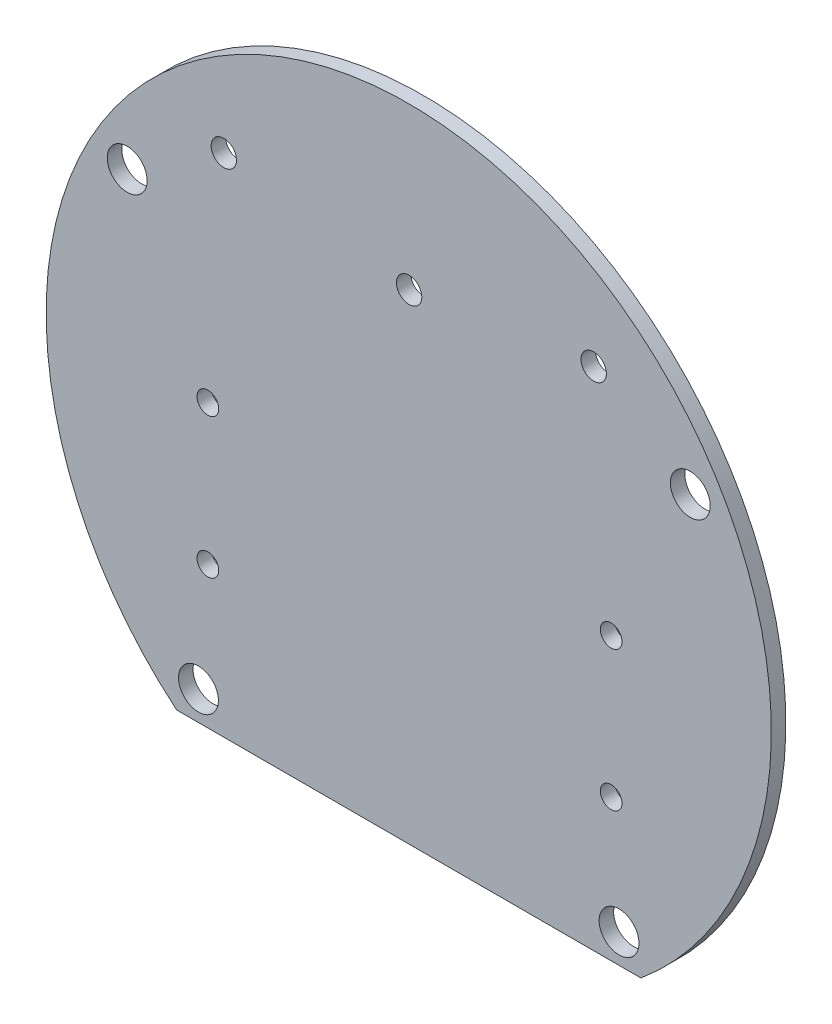
ISO-10303-21;
HEADER;
FILE_DESCRIPTION(('STEP AP214'),'2;1');
FILE_NAME('part.step','',(''),(''),'','','');
FILE_SCHEMA(('AUTOMOTIVE_DESIGN { 1 0 10303 214 1 1 1 1 }'));
ENDSEC;
DATA;
#1=APPLICATION_CONTEXT('core data for automotive mechanical design processes');
#2=APPLICATION_PROTOCOL_DEFINITION('international standard','automotive_design',2000,#1);
#3=PRODUCT_CONTEXT('',#1,'mechanical');
#4=PRODUCT('Part','Part','',(#3));
#5=PRODUCT_RELATED_PRODUCT_CATEGORY('part','',(#4));
#6=PRODUCT_DEFINITION_FORMATION('','',#4);
#7=PRODUCT_DEFINITION_CONTEXT('part definition',#1,'design');
#8=PRODUCT_DEFINITION('design','',#6,#7);
#9=PRODUCT_DEFINITION_SHAPE('','',#8);
#10=(LENGTH_UNIT() NAMED_UNIT(*) SI_UNIT(.MILLI.,.METRE.));
#11=(NAMED_UNIT(*) PLANE_ANGLE_UNIT() SI_UNIT($,.RADIAN.));
#12=(NAMED_UNIT(*) SI_UNIT($,.STERADIAN.) SOLID_ANGLE_UNIT());
#13=UNCERTAINTY_MEASURE_WITH_UNIT(LENGTH_MEASURE(1.E-05),#10,'distance_accuracy_value','');
#14=(GEOMETRIC_REPRESENTATION_CONTEXT(3) GLOBAL_UNCERTAINTY_ASSIGNED_CONTEXT((#13)) GLOBAL_UNIT_ASSIGNED_CONTEXT((#10,
#11,#12)) REPRESENTATION_CONTEXT('',''));
#15=CARTESIAN_POINT('',(0.,0.,0.));
#16=DIRECTION('',(0.,0.,1.));
#17=DIRECTION('',(1.,0.,0.));
#18=AXIS2_PLACEMENT_3D('',#15,#16,#17);
#19=CARTESIAN_POINT('',(0.,0.,2.));
#20=DIRECTION('',(0.,0.,-1.));
#21=DIRECTION('',(-1.,0.,0.));
#22=AXIS2_PLACEMENT_3D('',#19,#20,#21);
#23=CYLINDRICAL_SURFACE('',#22,50.);
#24=DIRECTION('',(0.,0.,-1.));
#25=VECTOR('',#24,1.);
#26=CARTESIAN_POINT('',(-32.0113353588168,-38.4093010681705,2.));
#27=LINE('',#26,#25);
#28=CARTESIAN_POINT('',(-32.0113353588168,-38.4093010681705,2.));
#29=VERTEX_POINT('',#28);
#30=CARTESIAN_POINT('',(-32.0113353588168,-38.4093010681705,0.));
#31=VERTEX_POINT('',#30);
#32=EDGE_CURVE('E49',#29,#31,#27,.T.);
#33=ORIENTED_EDGE('',*,*,#32,.F.);
#34=CARTESIAN_POINT('',(0.,0.,2.));
#35=DIRECTION('',(0.,0.,1.));
#36=DIRECTION('',(1.,0.,0.));
#37=AXIS2_PLACEMENT_3D('',#34,#35,#36);
#38=CIRCLE('',#37,50.);
#39=CARTESIAN_POINT('',(32.0113353588168,-38.4093010681705,2.));
#40=VERTEX_POINT('',#39);
#41=EDGE_CURVE('E43',#40,#29,#38,.T.);
#42=ORIENTED_EDGE('',*,*,#41,.F.);
#43=DIRECTION('',(0.,0.,-1.));
#44=VECTOR('',#43,1.);
#45=CARTESIAN_POINT('',(32.0113353588168,-38.4093010681705,2.));
#46=LINE('',#45,#44);
#47=CARTESIAN_POINT('',(32.0113353588168,-38.4093010681705,0.));
#48=VERTEX_POINT('',#47);
#49=EDGE_CURVE('E60',#48,#40,#46,.F.);
#50=ORIENTED_EDGE('',*,*,#49,.F.);
#51=CARTESIAN_POINT('',(0.,0.,0.));
#52=DIRECTION('',(0.,0.,1.));
#53=DIRECTION('',(1.,0.,0.));
#54=AXIS2_PLACEMENT_3D('',#51,#52,#53);
#55=CIRCLE('',#54,50.);
#56=EDGE_CURVE('E66',#48,#31,#55,.T.);
#57=ORIENTED_EDGE('',*,*,#56,.T.);
#58=EDGE_LOOP('',(#33,#42,#50,#57));
#59=FACE_BOUND('',#58,.T.);
#60=ADVANCED_FACE('F36',(#59),#23,.T.);
#61=CARTESIAN_POINT('',(0.,0.,2.));
#62=DIRECTION('',(0.,0.,1.));
#63=DIRECTION('',(1.,0.,0.));
#64=AXIS2_PLACEMENT_3D('',#61,#62,#63);
#65=PLANE('',#64);
#66=CARTESIAN_POINT('',(25.5,31.36,2.));
#67=DIRECTION('',(0.,0.,1.));
#68=DIRECTION('',(1.,0.,0.));
#69=AXIS2_PLACEMENT_3D('',#66,#67,#68);
#70=CIRCLE('',#69,1.75);
#71=CARTESIAN_POINT('',(27.25,31.36,2.));
#72=VERTEX_POINT('',#71);
#73=EDGE_CURVE('E68',#72,#72,#70,.T.);
#74=ORIENTED_EDGE('',*,*,#73,.F.);
#75=EDGE_LOOP('',(#74));
#76=FACE_BOUND('',#75,.T.);
#77=CARTESIAN_POINT('',(-25.5,31.36,2.));
#78=DIRECTION('',(0.,0.,1.));
#79=DIRECTION('',(1.,0.,0.));
#80=AXIS2_PLACEMENT_3D('',#77,#78,#79);
#81=CIRCLE('',#80,1.75);
#82=CARTESIAN_POINT('',(-23.75,31.36,2.));
#83=VERTEX_POINT('',#82);
#84=EDGE_CURVE('E101',#83,#83,#81,.T.);
#85=ORIENTED_EDGE('',*,*,#84,.F.);
#86=EDGE_LOOP('',(#85));
#87=FACE_BOUND('',#86,.T.);
#88=CARTESIAN_POINT('',(27.91,0.439999999999989,2.));
#89=DIRECTION('',(0.,0.,1.));
#90=DIRECTION('',(1.,0.,0.));
#91=AXIS2_PLACEMENT_3D('',#88,#89,#90);
#92=CIRCLE('',#91,1.5);
#93=CARTESIAN_POINT('',(29.41,0.439999999999989,2.));
#94=VERTEX_POINT('',#93);
#95=EDGE_CURVE('E104',#94,#94,#92,.T.);
#96=ORIENTED_EDGE('',*,*,#95,.F.);
#97=EDGE_LOOP('',(#96));
#98=FACE_BOUND('',#97,.T.);
#99=CARTESIAN_POINT('',(-27.7,0.439999999999996,2.));
#100=DIRECTION('',(0.,0.,1.));
#101=DIRECTION('',(1.,0.,0.));
#102=AXIS2_PLACEMENT_3D('',#99,#100,#101);
#103=CIRCLE('',#102,1.5);
#104=CARTESIAN_POINT('',(-26.2,0.439999999999996,2.));
#105=VERTEX_POINT('',#104);
#106=EDGE_CURVE('E107',#105,#105,#103,.T.);
#107=ORIENTED_EDGE('',*,*,#106,.F.);
#108=EDGE_LOOP('',(#107));
#109=FACE_BOUND('',#108,.T.);
#110=CARTESIAN_POINT('',(-27.7,-18.86,2.));
#111=DIRECTION('',(0.,0.,1.));
#112=DIRECTION('',(1.,0.,0.));
#113=AXIS2_PLACEMENT_3D('',#110,#111,#112);
#114=CIRCLE('',#113,1.5);
#115=CARTESIAN_POINT('',(-26.2,-18.86,2.));
#116=VERTEX_POINT('',#115);
#117=EDGE_CURVE('E110',#116,#116,#114,.T.);
#118=ORIENTED_EDGE('',*,*,#117,.F.);
#119=EDGE_LOOP('',(#118));
#120=FACE_BOUND('',#119,.T.);
#121=CARTESIAN_POINT('',(27.91,-18.86,2.));
#122=DIRECTION('',(0.,0.,1.));
#123=DIRECTION('',(1.,0.,0.));
#124=AXIS2_PLACEMENT_3D('',#121,#122,#123);
#125=CIRCLE('',#124,1.5);
#126=CARTESIAN_POINT('',(29.41,-18.86,2.));
#127=VERTEX_POINT('',#126);
#128=EDGE_CURVE('E113',#127,#127,#125,.T.);
#129=ORIENTED_EDGE('',*,*,#128,.F.);
#130=EDGE_LOOP('',(#129));
#131=FACE_BOUND('',#130,.T.);
#132=CARTESIAN_POINT('',(0.0499999999999968,27.79,2.));
#133=DIRECTION('',(0.,0.,1.));
#134=DIRECTION('',(1.,0.,0.));
#135=AXIS2_PLACEMENT_3D('',#132,#133,#134);
#136=CIRCLE('',#135,1.75);
#137=CARTESIAN_POINT('',(1.8,27.79,2.));
#138=VERTEX_POINT('',#137);
#139=EDGE_CURVE('E116',#138,#138,#136,.T.);
#140=ORIENTED_EDGE('',*,*,#139,.F.);
#141=EDGE_LOOP('',(#140));
#142=FACE_BOUND('',#141,.T.);
#143=CARTESIAN_POINT('',(38.8241975308642,22.7526193235952,2.));
#144=DIRECTION('',(0.,0.,1.));
#145=DIRECTION('',(1.,0.,0.));
#146=AXIS2_PLACEMENT_3D('',#143,#144,#145);
#147=CIRCLE('',#146,2.75);
#148=CARTESIAN_POINT('',(41.5741975308642,22.7526193235952,2.));
#149=VERTEX_POINT('',#148);
#150=EDGE_CURVE('E80',#149,#149,#147,.T.);
#151=ORIENTED_EDGE('',*,*,#150,.F.);
#152=EDGE_LOOP('',(#151));
#153=FACE_BOUND('',#152,.T.);
#154=CARTESIAN_POINT('',(-38.8241975308642,22.7526193235952,2.));
#155=DIRECTION('',(0.,0.,1.));
#156=DIRECTION('',(1.,0.,0.));
#157=AXIS2_PLACEMENT_3D('',#154,#155,#156);
#158=CIRCLE('',#157,2.75);
#159=CARTESIAN_POINT('',(-36.0741975308642,22.7526193235952,2.));
#160=VERTEX_POINT('',#159);
#161=EDGE_CURVE('E86',#160,#160,#158,.T.);
#162=ORIENTED_EDGE('',*,*,#161,.F.);
#163=EDGE_LOOP('',(#162));
#164=FACE_BOUND('',#163,.T.);
#165=CARTESIAN_POINT('',(29.,-34.4093010681705,2.));
#166=DIRECTION('',(0.,0.,1.));
#167=DIRECTION('',(1.,0.,0.));
#168=AXIS2_PLACEMENT_3D('',#165,#166,#167);
#169=CIRCLE('',#168,2.75);
#170=CARTESIAN_POINT('',(31.75,-34.4093010681705,2.));
#171=VERTEX_POINT('',#170);
#172=EDGE_CURVE('E92',#171,#171,#169,.T.);
#173=ORIENTED_EDGE('',*,*,#172,.F.);
#174=EDGE_LOOP('',(#173));
#175=FACE_BOUND('',#174,.T.);
#176=CARTESIAN_POINT('',(-29.,-34.4093010681705,2.));
#177=DIRECTION('',(0.,0.,1.));
#178=DIRECTION('',(1.,0.,0.));
#179=AXIS2_PLACEMENT_3D('',#176,#177,#178);
#180=CIRCLE('',#179,2.75);
#181=CARTESIAN_POINT('',(-26.25,-34.4093010681705,2.));
#182=VERTEX_POINT('',#181);
#183=EDGE_CURVE('E74',#182,#182,#180,.T.);
#184=ORIENTED_EDGE('',*,*,#183,.F.);
#185=EDGE_LOOP('',(#184));
#186=FACE_BOUND('',#185,.T.);
#187=ORIENTED_EDGE('',*,*,#41,.T.);
#188=DIRECTION('',(1.,0.,0.));
#189=VECTOR('',#188,1.);
#190=CARTESIAN_POINT('',(0.,-38.4093010681705,2.));
#191=LINE('',#190,#189);
#192=EDGE_CURVE('E54',#29,#40,#191,.T.);
#193=ORIENTED_EDGE('',*,*,#192,.T.);
#194=EDGE_LOOP('',(#187,#193));
#195=FACE_BOUND('',#194,.T.);
#196=ADVANCED_FACE('F146',(#76,#87,#98,#109,#120,#131,#142,#153,#164,#175,#186,#195),#65,.T.);
#197=CARTESIAN_POINT('',(0.,0.,0.));
#198=DIRECTION('',(0.,0.,1.));
#199=DIRECTION('',(1.,0.,0.));
#200=AXIS2_PLACEMENT_3D('',#197,#198,#199);
#201=PLANE('',#200);
#202=CARTESIAN_POINT('',(25.5,31.36,0.));
#203=DIRECTION('',(0.,0.,-1.));
#204=DIRECTION('',(-1.,0.,0.));
#205=AXIS2_PLACEMENT_3D('',#202,#203,#204);
#206=CIRCLE('',#205,1.75);
#207=CARTESIAN_POINT('',(23.75,31.36,0.));
#208=VERTEX_POINT('',#207);
#209=EDGE_CURVE('E123',#208,#208,#206,.T.);
#210=ORIENTED_EDGE('',*,*,#209,.F.);
#211=EDGE_LOOP('',(#210));
#212=FACE_BOUND('',#211,.T.);
#213=CARTESIAN_POINT('',(-25.5,31.36,0.));
#214=DIRECTION('',(0.,0.,-1.));
#215=DIRECTION('',(-1.,0.,0.));
#216=AXIS2_PLACEMENT_3D('',#213,#214,#215);
#217=CIRCLE('',#216,1.75);
#218=CARTESIAN_POINT('',(-27.25,31.36,0.));
#219=VERTEX_POINT('',#218);
#220=EDGE_CURVE('E126',#219,#219,#217,.T.);
#221=ORIENTED_EDGE('',*,*,#220,.F.);
#222=EDGE_LOOP('',(#221));
#223=FACE_BOUND('',#222,.T.);
#224=CARTESIAN_POINT('',(27.91,0.439999999999989,0.));
#225=DIRECTION('',(0.,0.,-1.));
#226=DIRECTION('',(-1.,0.,0.));
#227=AXIS2_PLACEMENT_3D('',#224,#225,#226);
#228=CIRCLE('',#227,1.5);
#229=CARTESIAN_POINT('',(26.41,0.439999999999989,0.));
#230=VERTEX_POINT('',#229);
#231=EDGE_CURVE('E129',#230,#230,#228,.T.);
#232=ORIENTED_EDGE('',*,*,#231,.F.);
#233=EDGE_LOOP('',(#232));
#234=FACE_BOUND('',#233,.T.);
#235=CARTESIAN_POINT('',(-27.7,0.439999999999996,0.));
#236=DIRECTION('',(0.,0.,-1.));
#237=DIRECTION('',(-1.,0.,0.));
#238=AXIS2_PLACEMENT_3D('',#235,#236,#237);
#239=CIRCLE('',#238,1.5);
#240=CARTESIAN_POINT('',(-29.2,0.439999999999996,0.));
#241=VERTEX_POINT('',#240);
#242=EDGE_CURVE('E132',#241,#241,#239,.T.);
#243=ORIENTED_EDGE('',*,*,#242,.F.);
#244=EDGE_LOOP('',(#243));
#245=FACE_BOUND('',#244,.T.);
#246=CARTESIAN_POINT('',(-27.7,-18.86,0.));
#247=DIRECTION('',(0.,0.,-1.));
#248=DIRECTION('',(-1.,0.,0.));
#249=AXIS2_PLACEMENT_3D('',#246,#247,#248);
#250=CIRCLE('',#249,1.5);
#251=CARTESIAN_POINT('',(-29.2,-18.86,0.));
#252=VERTEX_POINT('',#251);
#253=EDGE_CURVE('E135',#252,#252,#250,.T.);
#254=ORIENTED_EDGE('',*,*,#253,.F.);
#255=EDGE_LOOP('',(#254));
#256=FACE_BOUND('',#255,.T.);
#257=CARTESIAN_POINT('',(27.91,-18.86,0.));
#258=DIRECTION('',(0.,0.,-1.));
#259=DIRECTION('',(-1.,0.,0.));
#260=AXIS2_PLACEMENT_3D('',#257,#258,#259);
#261=CIRCLE('',#260,1.5);
#262=CARTESIAN_POINT('',(26.41,-18.86,0.));
#263=VERTEX_POINT('',#262);
#264=EDGE_CURVE('E122',#263,#263,#261,.T.);
#265=ORIENTED_EDGE('',*,*,#264,.F.);
#266=EDGE_LOOP('',(#265));
#267=FACE_BOUND('',#266,.T.);
#268=CARTESIAN_POINT('',(0.0499999999999968,27.79,0.));
#269=DIRECTION('',(0.,0.,-1.));
#270=DIRECTION('',(-1.,0.,0.));
#271=AXIS2_PLACEMENT_3D('',#268,#269,#270);
#272=CIRCLE('',#271,1.75);
#273=CARTESIAN_POINT('',(-1.7,27.79,0.));
#274=VERTEX_POINT('',#273);
#275=EDGE_CURVE('E119',#274,#274,#272,.T.);
#276=ORIENTED_EDGE('',*,*,#275,.F.);
#277=EDGE_LOOP('',(#276));
#278=FACE_BOUND('',#277,.T.);
#279=CARTESIAN_POINT('',(-29.,-34.4093010681705,0.));
#280=DIRECTION('',(0.,0.,1.));
#281=DIRECTION('',(1.,0.,0.));
#282=AXIS2_PLACEMENT_3D('',#279,#280,#281);
#283=CIRCLE('',#282,2.75);
#284=CARTESIAN_POINT('',(-26.25,-34.4093010681705,0.));
#285=VERTEX_POINT('',#284);
#286=EDGE_CURVE('E71',#285,#285,#283,.T.);
#287=ORIENTED_EDGE('',*,*,#286,.T.);
#288=EDGE_LOOP('',(#287));
#289=FACE_BOUND('',#288,.T.);
#290=CARTESIAN_POINT('',(29.,-34.4093010681705,0.));
#291=DIRECTION('',(0.,0.,1.));
#292=DIRECTION('',(1.,0.,0.));
#293=AXIS2_PLACEMENT_3D('',#290,#291,#292);
#294=CIRCLE('',#293,2.75);
#295=CARTESIAN_POINT('',(31.75,-34.4093010681705,0.));
#296=VERTEX_POINT('',#295);
#297=EDGE_CURVE('E78',#296,#296,#294,.T.);
#298=ORIENTED_EDGE('',*,*,#297,.T.);
#299=EDGE_LOOP('',(#298));
#300=FACE_BOUND('',#299,.T.);
#301=CARTESIAN_POINT('',(-38.8241975308642,22.7526193235952,0.));
#302=DIRECTION('',(0.,0.,1.));
#303=DIRECTION('',(1.,0.,0.));
#304=AXIS2_PLACEMENT_3D('',#301,#302,#303);
#305=CIRCLE('',#304,2.75);
#306=CARTESIAN_POINT('',(-36.0741975308642,22.7526193235952,0.));
#307=VERTEX_POINT('',#306);
#308=EDGE_CURVE('E89',#307,#307,#305,.T.);
#309=ORIENTED_EDGE('',*,*,#308,.T.);
#310=EDGE_LOOP('',(#309));
#311=FACE_BOUND('',#310,.T.);
#312=CARTESIAN_POINT('',(38.8241975308642,22.7526193235952,0.));
#313=DIRECTION('',(0.,0.,1.));
#314=DIRECTION('',(1.,0.,0.));
#315=AXIS2_PLACEMENT_3D('',#312,#313,#314);
#316=CIRCLE('',#315,2.75);
#317=CARTESIAN_POINT('',(41.5741975308642,22.7526193235952,0.));
#318=VERTEX_POINT('',#317);
#319=EDGE_CURVE('E83',#318,#318,#316,.T.);
#320=ORIENTED_EDGE('',*,*,#319,.T.);
#321=EDGE_LOOP('',(#320));
#322=FACE_BOUND('',#321,.T.);
#323=DIRECTION('',(1.,0.,0.));
#324=VECTOR('',#323,1.);
#325=CARTESIAN_POINT('',(0.,-38.4093010681705,0.));
#326=LINE('',#325,#324);
#327=EDGE_CURVE('E11',#31,#48,#326,.T.);
#328=ORIENTED_EDGE('',*,*,#327,.F.);
#329=ORIENTED_EDGE('',*,*,#56,.F.);
#330=EDGE_LOOP('',(#328,#329));
#331=FACE_BOUND('',#330,.T.);
#332=ADVANCED_FACE('F70',(#212,#223,#234,#245,#256,#267,#278,#289,#300,#311,#322,#331),#201,.F.);
#333=CARTESIAN_POINT('',(-29.,-34.4093010681705,0.));
#334=DIRECTION('',(0.,0.,1.));
#335=DIRECTION('',(1.,0.,0.));
#336=AXIS2_PLACEMENT_3D('',#333,#334,#335);
#337=CYLINDRICAL_SURFACE('',#336,2.75);
#338=ORIENTED_EDGE('',*,*,#286,.F.);
#339=EDGE_LOOP('',(#338));
#340=FACE_BOUND('',#339,.T.);
#341=ORIENTED_EDGE('',*,*,#183,.T.);
#342=EDGE_LOOP('',(#341));
#343=FACE_BOUND('',#342,.T.);
#344=ADVANCED_FACE('F145',(#340,#343),#337,.F.);
#345=CARTESIAN_POINT('',(29.,-34.4093010681705,0.));
#346=DIRECTION('',(0.,0.,1.));
#347=DIRECTION('',(1.,0.,0.));
#348=AXIS2_PLACEMENT_3D('',#345,#346,#347);
#349=CYLINDRICAL_SURFACE('',#348,2.75);
#350=ORIENTED_EDGE('',*,*,#297,.F.);
#351=EDGE_LOOP('',(#350));
#352=FACE_BOUND('',#351,.T.);
#353=ORIENTED_EDGE('',*,*,#172,.T.);
#354=EDGE_LOOP('',(#353));
#355=FACE_BOUND('',#354,.T.);
#356=ADVANCED_FACE('F177',(#352,#355),#349,.F.);
#357=CARTESIAN_POINT('',(-38.8241975308642,22.7526193235952,0.));
#358=DIRECTION('',(0.,0.,1.));
#359=DIRECTION('',(1.,0.,0.));
#360=AXIS2_PLACEMENT_3D('',#357,#358,#359);
#361=CYLINDRICAL_SURFACE('',#360,2.75);
#362=ORIENTED_EDGE('',*,*,#308,.F.);
#363=EDGE_LOOP('',(#362));
#364=FACE_BOUND('',#363,.T.);
#365=ORIENTED_EDGE('',*,*,#161,.T.);
#366=EDGE_LOOP('',(#365));
#367=FACE_BOUND('',#366,.T.);
#368=ADVANCED_FACE('F161',(#364,#367),#361,.F.);
#369=CARTESIAN_POINT('',(38.8241975308642,22.7526193235952,0.));
#370=DIRECTION('',(0.,0.,1.));
#371=DIRECTION('',(1.,0.,0.));
#372=AXIS2_PLACEMENT_3D('',#369,#370,#371);
#373=CYLINDRICAL_SURFACE('',#372,2.75);
#374=ORIENTED_EDGE('',*,*,#319,.F.);
#375=EDGE_LOOP('',(#374));
#376=FACE_BOUND('',#375,.T.);
#377=ORIENTED_EDGE('',*,*,#150,.T.);
#378=EDGE_LOOP('',(#377));
#379=FACE_BOUND('',#378,.T.);
#380=ADVANCED_FACE('F158',(#376,#379),#373,.F.);
#381=CARTESIAN_POINT('',(-40.7238599785686,-38.4093010681705,2.000012));
#382=DIRECTION('',(0.,-1.,0.));
#383=DIRECTION('',(0.,0.,-1.));
#384=AXIS2_PLACEMENT_3D('',#381,#382,#383);
#385=PLANE('',#384);
#386=ORIENTED_EDGE('',*,*,#32,.T.);
#387=ORIENTED_EDGE('',*,*,#327,.T.);
#388=ORIENTED_EDGE('',*,*,#49,.T.);
#389=ORIENTED_EDGE('',*,*,#192,.F.);
#390=EDGE_LOOP('',(#386,#387,#388,#389));
#391=FACE_BOUND('',#390,.T.);
#392=ADVANCED_FACE('F59',(#391),#385,.T.);
#393=CARTESIAN_POINT('',(0.0499999999999968,27.79,10.));
#394=DIRECTION('',(0.,0.,-1.));
#395=DIRECTION('',(-1.,0.,0.));
#396=AXIS2_PLACEMENT_3D('',#393,#394,#395);
#397=CYLINDRICAL_SURFACE('',#396,1.75);
#398=ORIENTED_EDGE('',*,*,#139,.T.);
#399=EDGE_LOOP('',(#398));
#400=FACE_BOUND('',#399,.T.);
#401=ORIENTED_EDGE('',*,*,#275,.T.);
#402=EDGE_LOOP('',(#401));
#403=FACE_BOUND('',#402,.T.);
#404=ADVANCED_FACE('F205',(#400,#403),#397,.F.);
#405=CARTESIAN_POINT('',(27.91,-18.86,10.));
#406=DIRECTION('',(0.,0.,-1.));
#407=DIRECTION('',(-1.,0.,0.));
#408=AXIS2_PLACEMENT_3D('',#405,#406,#407);
#409=CYLINDRICAL_SURFACE('',#408,1.5);
#410=ORIENTED_EDGE('',*,*,#128,.T.);
#411=EDGE_LOOP('',(#410));
#412=FACE_BOUND('',#411,.T.);
#413=ORIENTED_EDGE('',*,*,#264,.T.);
#414=EDGE_LOOP('',(#413));
#415=FACE_BOUND('',#414,.T.);
#416=ADVANCED_FACE('F141',(#412,#415),#409,.F.);
#417=CARTESIAN_POINT('',(-27.7,-18.86,10.));
#418=DIRECTION('',(0.,0.,-1.));
#419=DIRECTION('',(-1.,0.,0.));
#420=AXIS2_PLACEMENT_3D('',#417,#418,#419);
#421=CYLINDRICAL_SURFACE('',#420,1.5);
#422=ORIENTED_EDGE('',*,*,#117,.T.);
#423=EDGE_LOOP('',(#422));
#424=FACE_BOUND('',#423,.T.);
#425=ORIENTED_EDGE('',*,*,#253,.T.);
#426=EDGE_LOOP('',(#425));
#427=FACE_BOUND('',#426,.T.);
#428=ADVANCED_FACE('F223',(#424,#427),#421,.F.);
#429=CARTESIAN_POINT('',(-27.7,0.439999999999996,10.));
#430=DIRECTION('',(0.,0.,-1.));
#431=DIRECTION('',(-1.,0.,0.));
#432=AXIS2_PLACEMENT_3D('',#429,#430,#431);
#433=CYLINDRICAL_SURFACE('',#432,1.5);
#434=ORIENTED_EDGE('',*,*,#106,.T.);
#435=EDGE_LOOP('',(#434));
#436=FACE_BOUND('',#435,.T.);
#437=ORIENTED_EDGE('',*,*,#242,.T.);
#438=EDGE_LOOP('',(#437));
#439=FACE_BOUND('',#438,.T.);
#440=ADVANCED_FACE('F231',(#436,#439),#433,.F.);
#441=CARTESIAN_POINT('',(27.91,0.439999999999989,10.));
#442=DIRECTION('',(0.,0.,-1.));
#443=DIRECTION('',(-1.,0.,0.));
#444=AXIS2_PLACEMENT_3D('',#441,#442,#443);
#445=CYLINDRICAL_SURFACE('',#444,1.5);
#446=ORIENTED_EDGE('',*,*,#95,.T.);
#447=EDGE_LOOP('',(#446));
#448=FACE_BOUND('',#447,.T.);
#449=ORIENTED_EDGE('',*,*,#231,.T.);
#450=EDGE_LOOP('',(#449));
#451=FACE_BOUND('',#450,.T.);
#452=ADVANCED_FACE('F239',(#448,#451),#445,.F.);
#453=CARTESIAN_POINT('',(-25.5,31.36,10.));
#454=DIRECTION('',(0.,0.,-1.));
#455=DIRECTION('',(-1.,0.,0.));
#456=AXIS2_PLACEMENT_3D('',#453,#454,#455);
#457=CYLINDRICAL_SURFACE('',#456,1.75);
#458=ORIENTED_EDGE('',*,*,#84,.T.);
#459=EDGE_LOOP('',(#458));
#460=FACE_BOUND('',#459,.T.);
#461=ORIENTED_EDGE('',*,*,#220,.T.);
#462=EDGE_LOOP('',(#461));
#463=FACE_BOUND('',#462,.T.);
#464=ADVANCED_FACE('F247',(#460,#463),#457,.F.);
#465=CARTESIAN_POINT('',(25.5,31.36,10.));
#466=DIRECTION('',(0.,0.,-1.));
#467=DIRECTION('',(-1.,0.,0.));
#468=AXIS2_PLACEMENT_3D('',#465,#466,#467);
#469=CYLINDRICAL_SURFACE('',#468,1.75);
#470=ORIENTED_EDGE('',*,*,#73,.T.);
#471=EDGE_LOOP('',(#470));
#472=FACE_BOUND('',#471,.T.);
#473=ORIENTED_EDGE('',*,*,#209,.T.);
#474=EDGE_LOOP('',(#473));
#475=FACE_BOUND('',#474,.T.);
#476=ADVANCED_FACE('F255',(#472,#475),#469,.F.);
#477=CLOSED_SHELL('',(#60,#196,#332,#344,#356,#368,#380,#392,#404,#416,#428,#440,#452,#464,#476));
#478=MANIFOLD_SOLID_BREP('B2',#477);
#479=ADVANCED_BREP_SHAPE_REPRESENTATION('',(#18,#478),#14);
#480=SHAPE_DEFINITION_REPRESENTATION(#9,#479);
ENDSEC;
END-ISO-10303-21;
